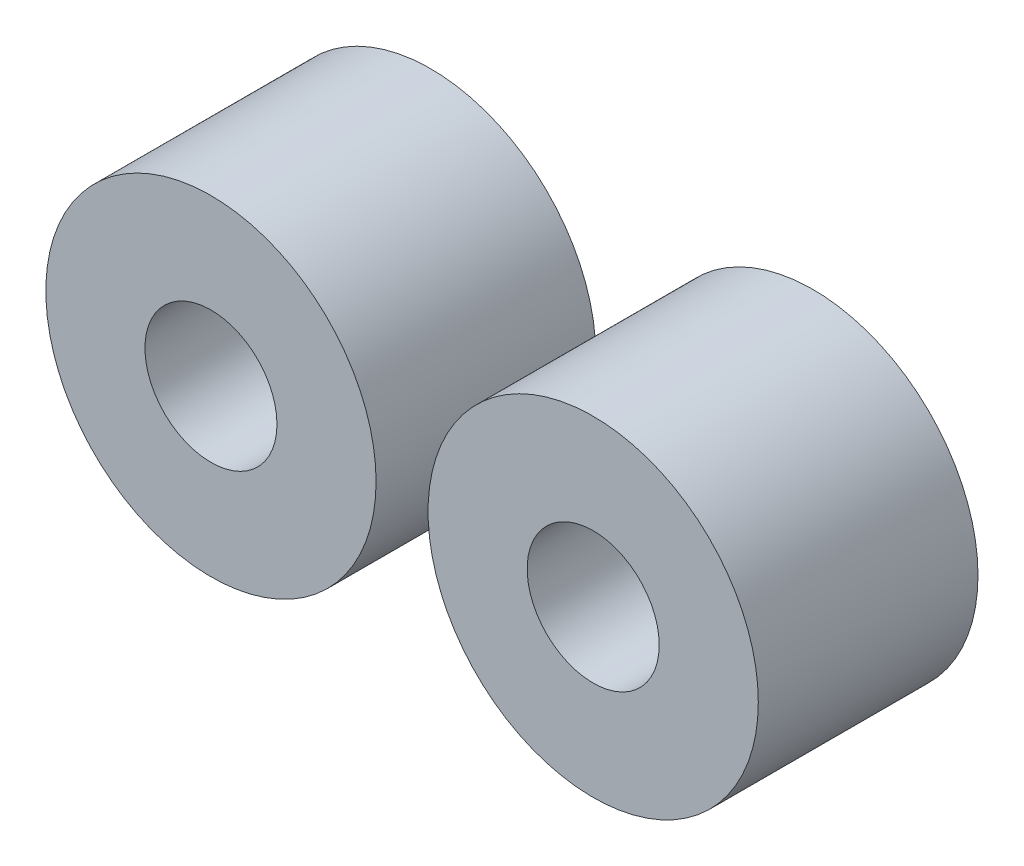
ISO-10303-21;
HEADER;
FILE_DESCRIPTION(('STEP AP214'),'2;1');
FILE_NAME('part.step','',(''),(''),'','','');
FILE_SCHEMA(('AUTOMOTIVE_DESIGN { 1 0 10303 214 1 1 1 1 }'));
ENDSEC;
DATA;
#1=APPLICATION_CONTEXT('core data for automotive mechanical design processes');
#2=APPLICATION_PROTOCOL_DEFINITION('international standard','automotive_design',2000,#1);
#3=PRODUCT_CONTEXT('',#1,'mechanical');
#4=PRODUCT('Part','Part','',(#3));
#5=PRODUCT_RELATED_PRODUCT_CATEGORY('part','',(#4));
#6=PRODUCT_DEFINITION_FORMATION('','',#4);
#7=PRODUCT_DEFINITION_CONTEXT('part definition',#1,'design');
#8=PRODUCT_DEFINITION('design','',#6,#7);
#9=PRODUCT_DEFINITION_SHAPE('','',#8);
#10=(LENGTH_UNIT() NAMED_UNIT(*) SI_UNIT(.MILLI.,.METRE.));
#11=(NAMED_UNIT(*) PLANE_ANGLE_UNIT() SI_UNIT($,.RADIAN.));
#12=(NAMED_UNIT(*) SI_UNIT($,.STERADIAN.) SOLID_ANGLE_UNIT());
#13=UNCERTAINTY_MEASURE_WITH_UNIT(LENGTH_MEASURE(1.E-05),#10,'distance_accuracy_value','');
#14=(GEOMETRIC_REPRESENTATION_CONTEXT(3) GLOBAL_UNCERTAINTY_ASSIGNED_CONTEXT((#13)) GLOBAL_UNIT_ASSIGNED_CONTEXT((#10,
#11,#12)) REPRESENTATION_CONTEXT('',''));
#15=CARTESIAN_POINT('',(0.,0.,0.));
#16=DIRECTION('',(0.,0.,1.));
#17=DIRECTION('',(1.,0.,0.));
#18=AXIS2_PLACEMENT_3D('',#15,#16,#17);
#19=CARTESIAN_POINT('',(2206.,0.,1268.));
#20=DIRECTION('',(0.,0.,1.));
#21=DIRECTION('',(1.,0.,0.));
#22=AXIS2_PLACEMENT_3D('',#19,#20,#21);
#23=PLANE('',#22);
#24=CARTESIAN_POINT('',(2206.,0.,1268.));
#25=DIRECTION('',(0.,0.,1.));
#26=DIRECTION('',(1.,0.,0.));
#27=AXIS2_PLACEMENT_3D('',#24,#25,#26);
#28=CIRCLE('',#27,953.);
#29=CARTESIAN_POINT('',(3159.,0.,1268.));
#30=VERTEX_POINT('',#29);
#31=EDGE_CURVE('E64',#30,#30,#28,.T.);
#32=ORIENTED_EDGE('',*,*,#31,.T.);
#33=EDGE_LOOP('',(#32));
#34=FACE_BOUND('',#33,.T.);
#35=CARTESIAN_POINT('',(2206.,0.,1268.));
#36=DIRECTION('',(0.,0.,1.));
#37=DIRECTION('',(1.,0.,0.));
#38=AXIS2_PLACEMENT_3D('',#35,#36,#37);
#39=CIRCLE('',#38,381.);
#40=CARTESIAN_POINT('',(2587.,0.,1268.));
#41=VERTEX_POINT('',#40);
#42=EDGE_CURVE('E55',#41,#41,#39,.T.);
#43=ORIENTED_EDGE('',*,*,#42,.F.);
#44=EDGE_LOOP('',(#43));
#45=FACE_BOUND('',#44,.T.);
#46=ADVANCED_FACE('F51',(#34,#45),#23,.T.);
#47=CARTESIAN_POINT('',(2206.,0.,0.));
#48=DIRECTION('',(0.,0.,1.));
#49=DIRECTION('',(1.,0.,0.));
#50=AXIS2_PLACEMENT_3D('',#47,#48,#49);
#51=PLANE('',#50);
#52=CARTESIAN_POINT('',(2206.,0.,0.));
#53=DIRECTION('',(0.,0.,1.));
#54=DIRECTION('',(1.,0.,0.));
#55=AXIS2_PLACEMENT_3D('',#52,#53,#54);
#56=CIRCLE('',#55,953.);
#57=CARTESIAN_POINT('',(3159.,0.,0.));
#58=VERTEX_POINT('',#57);
#59=EDGE_CURVE('E62',#58,#58,#56,.T.);
#60=ORIENTED_EDGE('',*,*,#59,.F.);
#61=EDGE_LOOP('',(#60));
#62=FACE_BOUND('',#61,.T.);
#63=CARTESIAN_POINT('',(2206.,0.,0.));
#64=DIRECTION('',(0.,0.,1.));
#65=DIRECTION('',(1.,0.,0.));
#66=AXIS2_PLACEMENT_3D('',#63,#64,#65);
#67=CIRCLE('',#66,381.);
#68=CARTESIAN_POINT('',(2587.,0.,0.));
#69=VERTEX_POINT('',#68);
#70=EDGE_CURVE('E11',#69,#69,#67,.T.);
#71=ORIENTED_EDGE('',*,*,#70,.T.);
#72=EDGE_LOOP('',(#71));
#73=FACE_BOUND('',#72,.T.);
#74=ADVANCED_FACE('F72',(#62,#73),#51,.F.);
#75=CARTESIAN_POINT('',(2206.,0.,1268.));
#76=DIRECTION('',(0.,0.,-1.));
#77=DIRECTION('',(-1.,0.,0.));
#78=AXIS2_PLACEMENT_3D('',#75,#76,#77);
#79=CYLINDRICAL_SURFACE('',#78,953.);
#80=ORIENTED_EDGE('',*,*,#31,.F.);
#81=EDGE_LOOP('',(#80));
#82=FACE_BOUND('',#81,.T.);
#83=ORIENTED_EDGE('',*,*,#59,.T.);
#84=EDGE_LOOP('',(#83));
#85=FACE_BOUND('',#84,.T.);
#86=ADVANCED_FACE('F70',(#82,#85),#79,.T.);
#87=CARTESIAN_POINT('',(2206.,0.,1268.));
#88=DIRECTION('',(0.,0.,-1.));
#89=DIRECTION('',(-1.,0.,0.));
#90=AXIS2_PLACEMENT_3D('',#87,#88,#89);
#91=CYLINDRICAL_SURFACE('',#90,381.);
#92=ORIENTED_EDGE('',*,*,#42,.T.);
#93=EDGE_LOOP('',(#92));
#94=FACE_BOUND('',#93,.T.);
#95=ORIENTED_EDGE('',*,*,#70,.F.);
#96=EDGE_LOOP('',(#95));
#97=FACE_BOUND('',#96,.T.);
#98=ADVANCED_FACE('F53',(#94,#97),#91,.F.);
#99=CLOSED_SHELL('',(#46,#74,#86,#98));
#100=MANIFOLD_SOLID_BREP('B2',#99);
#101=CARTESIAN_POINT('',(0.,0.,1268.));
#102=DIRECTION('',(0.,0.,1.));
#103=DIRECTION('',(1.,0.,0.));
#104=AXIS2_PLACEMENT_3D('',#101,#102,#103);
#105=PLANE('',#104);
#106=CARTESIAN_POINT('',(0.,0.,1268.));
#107=DIRECTION('',(0.,0.,1.));
#108=DIRECTION('',(1.,0.,0.));
#109=AXIS2_PLACEMENT_3D('',#106,#107,#108);
#110=CIRCLE('',#109,953.);
#111=CARTESIAN_POINT('',(953.,0.,1268.));
#112=VERTEX_POINT('',#111);
#113=EDGE_CURVE('E50',#112,#112,#110,.T.);
#114=ORIENTED_EDGE('',*,*,#113,.T.);
#115=EDGE_LOOP('',(#114));
#116=FACE_BOUND('',#115,.T.);
#117=CARTESIAN_POINT('',(0.,0.,1268.));
#118=DIRECTION('',(0.,0.,1.));
#119=DIRECTION('',(1.,0.,0.));
#120=AXIS2_PLACEMENT_3D('',#117,#118,#119);
#121=CIRCLE('',#120,381.);
#122=CARTESIAN_POINT('',(381.,0.,1268.));
#123=VERTEX_POINT('',#122);
#124=EDGE_CURVE('E132',#123,#123,#121,.T.);
#125=ORIENTED_EDGE('',*,*,#124,.F.);
#126=EDGE_LOOP('',(#125));
#127=FACE_BOUND('',#126,.T.);
#128=ADVANCED_FACE('F121',(#116,#127),#105,.T.);
#129=CARTESIAN_POINT('',(0.,0.,0.));
#130=DIRECTION('',(0.,0.,1.));
#131=DIRECTION('',(1.,0.,0.));
#132=AXIS2_PLACEMENT_3D('',#129,#130,#131);
#133=PLANE('',#132);
#134=CARTESIAN_POINT('',(0.,0.,0.));
#135=DIRECTION('',(0.,0.,1.));
#136=DIRECTION('',(1.,0.,0.));
#137=AXIS2_PLACEMENT_3D('',#134,#135,#136);
#138=CIRCLE('',#137,953.);
#139=CARTESIAN_POINT('',(953.,0.,0.));
#140=VERTEX_POINT('',#139);
#141=EDGE_CURVE('E125',#140,#140,#138,.T.);
#142=ORIENTED_EDGE('',*,*,#141,.F.);
#143=EDGE_LOOP('',(#142));
#144=FACE_BOUND('',#143,.T.);
#145=CARTESIAN_POINT('',(0.,0.,0.));
#146=DIRECTION('',(0.,0.,1.));
#147=DIRECTION('',(1.,0.,0.));
#148=AXIS2_PLACEMENT_3D('',#145,#146,#147);
#149=CIRCLE('',#148,381.);
#150=CARTESIAN_POINT('',(381.,0.,0.));
#151=VERTEX_POINT('',#150);
#152=EDGE_CURVE('E134',#151,#151,#149,.T.);
#153=ORIENTED_EDGE('',*,*,#152,.T.);
#154=EDGE_LOOP('',(#153));
#155=FACE_BOUND('',#154,.T.);
#156=ADVANCED_FACE('F144',(#144,#155),#133,.F.);
#157=CARTESIAN_POINT('',(0.,0.,1268.));
#158=DIRECTION('',(0.,0.,-1.));
#159=DIRECTION('',(-1.,0.,0.));
#160=AXIS2_PLACEMENT_3D('',#157,#158,#159);
#161=CYLINDRICAL_SURFACE('',#160,953.);
#162=ORIENTED_EDGE('',*,*,#113,.F.);
#163=EDGE_LOOP('',(#162));
#164=FACE_BOUND('',#163,.T.);
#165=ORIENTED_EDGE('',*,*,#141,.T.);
#166=EDGE_LOOP('',(#165));
#167=FACE_BOUND('',#166,.T.);
#168=ADVANCED_FACE('F123',(#164,#167),#161,.T.);
#169=CARTESIAN_POINT('',(0.,0.,1268.));
#170=DIRECTION('',(0.,0.,-1.));
#171=DIRECTION('',(-1.,0.,0.));
#172=AXIS2_PLACEMENT_3D('',#169,#170,#171);
#173=CYLINDRICAL_SURFACE('',#172,381.);
#174=ORIENTED_EDGE('',*,*,#124,.T.);
#175=EDGE_LOOP('',(#174));
#176=FACE_BOUND('',#175,.T.);
#177=ORIENTED_EDGE('',*,*,#152,.F.);
#178=EDGE_LOOP('',(#177));
#179=FACE_BOUND('',#178,.T.);
#180=ADVANCED_FACE('F140',(#176,#179),#173,.F.);
#181=CLOSED_SHELL('',(#128,#156,#168,#180));
#182=MANIFOLD_SOLID_BREP('B6',#181);
#183=ADVANCED_BREP_SHAPE_REPRESENTATION('',(#18,#100,#182),#14);
#184=SHAPE_DEFINITION_REPRESENTATION(#9,#183);
ENDSEC;
END-ISO-10303-21;
